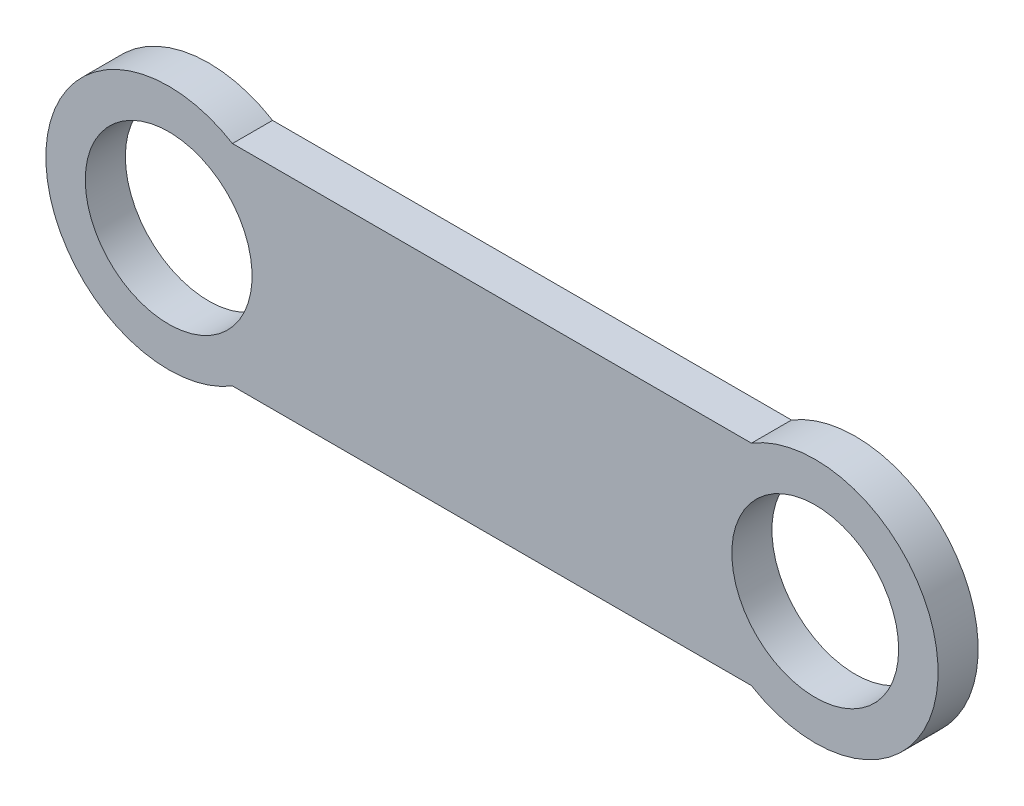
ISO-10303-21;
HEADER;
FILE_DESCRIPTION(('STEP AP214'),'2;1');
FILE_NAME('part.step','',(''),(''),'','','');
FILE_SCHEMA(('AUTOMOTIVE_DESIGN { 1 0 10303 214 1 1 1 1 }'));
ENDSEC;
DATA;
#1=APPLICATION_CONTEXT('core data for automotive mechanical design processes');
#2=APPLICATION_PROTOCOL_DEFINITION('international standard','automotive_design',2000,#1);
#3=PRODUCT_CONTEXT('',#1,'mechanical');
#4=PRODUCT('Part','Part','',(#3));
#5=PRODUCT_RELATED_PRODUCT_CATEGORY('part','',(#4));
#6=PRODUCT_DEFINITION_FORMATION('','',#4);
#7=PRODUCT_DEFINITION_CONTEXT('part definition',#1,'design');
#8=PRODUCT_DEFINITION('design','',#6,#7);
#9=PRODUCT_DEFINITION_SHAPE('','',#8);
#10=(LENGTH_UNIT() NAMED_UNIT(*) SI_UNIT(.MILLI.,.METRE.));
#11=(NAMED_UNIT(*) PLANE_ANGLE_UNIT() SI_UNIT($,.RADIAN.));
#12=(NAMED_UNIT(*) SI_UNIT($,.STERADIAN.) SOLID_ANGLE_UNIT());
#13=UNCERTAINTY_MEASURE_WITH_UNIT(LENGTH_MEASURE(1.E-05),#10,'distance_accuracy_value','');
#14=(GEOMETRIC_REPRESENTATION_CONTEXT(3) GLOBAL_UNCERTAINTY_ASSIGNED_CONTEXT((#13)) GLOBAL_UNIT_ASSIGNED_CONTEXT((#10,
#11,#12)) REPRESENTATION_CONTEXT('',''));
#15=CARTESIAN_POINT('',(0.,0.,0.));
#16=DIRECTION('',(0.,0.,1.));
#17=DIRECTION('',(1.,0.,0.));
#18=AXIS2_PLACEMENT_3D('',#15,#16,#17);
#19=CARTESIAN_POINT('',(25.,0.,3.1));
#20=DIRECTION('',(0.,0.,-1.));
#21=DIRECTION('',(-1.,0.,0.));
#22=AXIS2_PLACEMENT_3D('',#19,#20,#21);
#23=PLANE('',#22);
#24=CARTESIAN_POINT('',(25.,0.,3.1));
#25=DIRECTION('',(0.,0.,1.));
#26=DIRECTION('',(1.,0.,0.));
#27=AXIS2_PLACEMENT_3D('',#24,#25,#26);
#28=CIRCLE('',#27,6.45);
#29=CARTESIAN_POINT('',(31.45,0.,3.1));
#30=VERTEX_POINT('',#29);
#31=EDGE_CURVE('E99',#30,#30,#28,.T.);
#32=ORIENTED_EDGE('',*,*,#31,.F.);
#33=EDGE_LOOP('',(#32));
#34=FACE_BOUND('',#33,.T.);
#35=CARTESIAN_POINT('',(25.,0.,3.1));
#36=DIRECTION('',(0.,0.,1.));
#37=DIRECTION('',(-1.,0.,0.));
#38=AXIS2_PLACEMENT_3D('',#35,#36,#37);
#39=CIRCLE('',#38,9.5);
#40=CARTESIAN_POINT('',(20.0665095780993,-8.11853880061023,3.1));
#41=VERTEX_POINT('',#40);
#42=CARTESIAN_POINT('',(20.0665095780993,8.11853880061023,3.1));
#43=VERTEX_POINT('',#42);
#44=EDGE_CURVE('E84',#41,#43,#39,.T.);
#45=ORIENTED_EDGE('',*,*,#44,.T.);
#46=DIRECTION('',(-1.,0.,0.));
#47=VECTOR('',#46,1.);
#48=CARTESIAN_POINT('',(-20.0665095780993,8.11853880061023,3.1));
#49=LINE('',#48,#47);
#50=CARTESIAN_POINT('',(-20.0665095780993,8.11853880061023,3.1));
#51=VERTEX_POINT('',#50);
#52=EDGE_CURVE('E79',#43,#51,#49,.T.);
#53=ORIENTED_EDGE('',*,*,#52,.T.);
#54=CARTESIAN_POINT('',(-25.,0.,3.1));
#55=DIRECTION('',(0.,0.,1.));
#56=DIRECTION('',(1.,0.,0.));
#57=AXIS2_PLACEMENT_3D('',#54,#55,#56);
#58=CIRCLE('',#57,9.5);
#59=CARTESIAN_POINT('',(-20.0665095780993,-8.11853880061023,3.1));
#60=VERTEX_POINT('',#59);
#61=EDGE_CURVE('E82',#51,#60,#58,.T.);
#62=ORIENTED_EDGE('',*,*,#61,.T.);
#63=DIRECTION('',(1.,0.,0.));
#64=VECTOR('',#63,1.);
#65=CARTESIAN_POINT('',(-20.0665095780993,-8.11853880061023,3.1));
#66=LINE('',#65,#64);
#67=EDGE_CURVE('E49',#60,#41,#66,.T.);
#68=ORIENTED_EDGE('',*,*,#67,.T.);
#69=EDGE_LOOP('',(#45,#53,#62,#68));
#70=FACE_BOUND('',#69,.T.);
#71=CARTESIAN_POINT('',(-25.,0.,3.1));
#72=DIRECTION('',(0.,0.,1.));
#73=DIRECTION('',(-1.,0.,0.));
#74=AXIS2_PLACEMENT_3D('',#71,#72,#73);
#75=CIRCLE('',#74,6.45);
#76=CARTESIAN_POINT('',(-31.45,0.,3.1));
#77=VERTEX_POINT('',#76);
#78=EDGE_CURVE('E114',#77,#77,#75,.T.);
#79=ORIENTED_EDGE('',*,*,#78,.F.);
#80=EDGE_LOOP('',(#79));
#81=FACE_BOUND('',#80,.T.);
#82=ADVANCED_FACE('F32',(#34,#70,#81),#23,.F.);
#83=CARTESIAN_POINT('',(25.,0.,0.));
#84=DIRECTION('',(0.,0.,-1.));
#85=DIRECTION('',(-1.,0.,0.));
#86=AXIS2_PLACEMENT_3D('',#83,#84,#85);
#87=PLANE('',#86);
#88=CARTESIAN_POINT('',(25.,0.,0.));
#89=DIRECTION('',(0.,0.,1.));
#90=DIRECTION('',(1.,0.,0.));
#91=AXIS2_PLACEMENT_3D('',#88,#89,#90);
#92=CIRCLE('',#91,6.45);
#93=CARTESIAN_POINT('',(31.45,0.,0.));
#94=VERTEX_POINT('',#93);
#95=EDGE_CURVE('E111',#94,#94,#92,.T.);
#96=ORIENTED_EDGE('',*,*,#95,.T.);
#97=EDGE_LOOP('',(#96));
#98=FACE_BOUND('',#97,.T.);
#99=CARTESIAN_POINT('',(25.,0.,0.));
#100=DIRECTION('',(0.,0.,1.));
#101=DIRECTION('',(-1.,0.,0.));
#102=AXIS2_PLACEMENT_3D('',#99,#100,#101);
#103=CIRCLE('',#102,9.5);
#104=CARTESIAN_POINT('',(20.0665095780993,-8.11853880061023,0.));
#105=VERTEX_POINT('',#104);
#106=CARTESIAN_POINT('',(20.0665095780993,8.11853880061023,0.));
#107=VERTEX_POINT('',#106);
#108=EDGE_CURVE('E96',#105,#107,#103,.T.);
#109=ORIENTED_EDGE('',*,*,#108,.F.);
#110=DIRECTION('',(1.,0.,0.));
#111=VECTOR('',#110,1.);
#112=CARTESIAN_POINT('',(-20.0665095780993,-8.11853880061023,0.));
#113=LINE('',#112,#111);
#114=CARTESIAN_POINT('',(-20.0665095780993,-8.11853880061023,0.));
#115=VERTEX_POINT('',#114);
#116=EDGE_CURVE('E72',#115,#105,#113,.T.);
#117=ORIENTED_EDGE('',*,*,#116,.F.);
#118=CARTESIAN_POINT('',(-25.,0.,0.));
#119=DIRECTION('',(0.,0.,1.));
#120=DIRECTION('',(1.,0.,0.));
#121=AXIS2_PLACEMENT_3D('',#118,#119,#120);
#122=CIRCLE('',#121,9.5);
#123=CARTESIAN_POINT('',(-20.0665095780993,8.11853880061023,0.));
#124=VERTEX_POINT('',#123);
#125=EDGE_CURVE('E66',#124,#115,#122,.T.);
#126=ORIENTED_EDGE('',*,*,#125,.F.);
#127=DIRECTION('',(-1.,0.,0.));
#128=VECTOR('',#127,1.);
#129=CARTESIAN_POINT('',(-20.0665095780993,8.11853880061023,0.));
#130=LINE('',#129,#128);
#131=EDGE_CURVE('E88',#107,#124,#130,.T.);
#132=ORIENTED_EDGE('',*,*,#131,.F.);
#133=EDGE_LOOP('',(#109,#117,#126,#132));
#134=FACE_BOUND('',#133,.T.);
#135=CARTESIAN_POINT('',(-25.,0.,0.));
#136=DIRECTION('',(0.,0.,1.));
#137=DIRECTION('',(-1.,0.,0.));
#138=AXIS2_PLACEMENT_3D('',#135,#136,#137);
#139=CIRCLE('',#138,6.45);
#140=CARTESIAN_POINT('',(-31.45,0.,0.));
#141=VERTEX_POINT('',#140);
#142=EDGE_CURVE('E117',#141,#141,#139,.T.);
#143=ORIENTED_EDGE('',*,*,#142,.T.);
#144=EDGE_LOOP('',(#143));
#145=FACE_BOUND('',#144,.T.);
#146=ADVANCED_FACE('F107',(#98,#134,#145),#87,.T.);
#147=CARTESIAN_POINT('',(25.,0.,3.1));
#148=DIRECTION('',(0.,0.,-1.));
#149=DIRECTION('',(-1.,0.,0.));
#150=AXIS2_PLACEMENT_3D('',#147,#148,#149);
#151=CYLINDRICAL_SURFACE('',#150,9.5);
#152=ORIENTED_EDGE('',*,*,#108,.T.);
#153=DIRECTION('',(0.,0.,-1.));
#154=VECTOR('',#153,1.);
#155=CARTESIAN_POINT('',(20.0665095780993,8.11853880061023,3.1));
#156=LINE('',#155,#154);
#157=EDGE_CURVE('E11',#43,#107,#156,.T.);
#158=ORIENTED_EDGE('',*,*,#157,.F.);
#159=ORIENTED_EDGE('',*,*,#44,.F.);
#160=DIRECTION('',(0.,0.,-1.));
#161=VECTOR('',#160,1.);
#162=CARTESIAN_POINT('',(20.0665095780993,-8.11853880061023,3.1));
#163=LINE('',#162,#161);
#164=EDGE_CURVE('E92',#41,#105,#163,.T.);
#165=ORIENTED_EDGE('',*,*,#164,.T.);
#166=EDGE_LOOP('',(#152,#158,#159,#165));
#167=FACE_BOUND('',#166,.T.);
#168=ADVANCED_FACE('F34',(#167),#151,.T.);
#169=CARTESIAN_POINT('',(-20.0665095780993,8.11853880061023,3.1));
#170=DIRECTION('',(0.,-1.,0.));
#171=DIRECTION('',(0.,0.,-1.));
#172=AXIS2_PLACEMENT_3D('',#169,#170,#171);
#173=PLANE('',#172);
#174=ORIENTED_EDGE('',*,*,#131,.T.);
#175=DIRECTION('',(0.,0.,-1.));
#176=VECTOR('',#175,1.);
#177=CARTESIAN_POINT('',(-20.0665095780993,8.11853880061023,3.1));
#178=LINE('',#177,#176);
#179=EDGE_CURVE('E41',#51,#124,#178,.T.);
#180=ORIENTED_EDGE('',*,*,#179,.F.);
#181=ORIENTED_EDGE('',*,*,#52,.F.);
#182=ORIENTED_EDGE('',*,*,#157,.T.);
#183=EDGE_LOOP('',(#174,#180,#181,#182));
#184=FACE_BOUND('',#183,.T.);
#185=ADVANCED_FACE('F87',(#184),#173,.F.);
#186=CARTESIAN_POINT('',(-25.,0.,3.1));
#187=DIRECTION('',(0.,0.,-1.));
#188=DIRECTION('',(-1.,0.,0.));
#189=AXIS2_PLACEMENT_3D('',#186,#187,#188);
#190=CYLINDRICAL_SURFACE('',#189,9.5);
#191=ORIENTED_EDGE('',*,*,#125,.T.);
#192=DIRECTION('',(0.,0.,-1.));
#193=VECTOR('',#192,1.);
#194=CARTESIAN_POINT('',(-20.0665095780993,-8.11853880061023,3.1));
#195=LINE('',#194,#193);
#196=EDGE_CURVE('E89',#60,#115,#195,.T.);
#197=ORIENTED_EDGE('',*,*,#196,.F.);
#198=ORIENTED_EDGE('',*,*,#61,.F.);
#199=ORIENTED_EDGE('',*,*,#179,.T.);
#200=EDGE_LOOP('',(#191,#197,#198,#199));
#201=FACE_BOUND('',#200,.T.);
#202=ADVANCED_FACE('F90',(#201),#190,.T.);
#203=CARTESIAN_POINT('',(-20.0665095780993,-8.11853880061023,3.1));
#204=DIRECTION('',(0.,1.,0.));
#205=DIRECTION('',(0.,0.,1.));
#206=AXIS2_PLACEMENT_3D('',#203,#204,#205);
#207=PLANE('',#206);
#208=ORIENTED_EDGE('',*,*,#116,.T.);
#209=ORIENTED_EDGE('',*,*,#164,.F.);
#210=ORIENTED_EDGE('',*,*,#67,.F.);
#211=ORIENTED_EDGE('',*,*,#196,.T.);
#212=EDGE_LOOP('',(#208,#209,#210,#211));
#213=FACE_BOUND('',#212,.T.);
#214=ADVANCED_FACE('F104',(#213),#207,.F.);
#215=CARTESIAN_POINT('',(25.,0.,3.1));
#216=DIRECTION('',(0.,0.,-1.));
#217=DIRECTION('',(-1.,0.,0.));
#218=AXIS2_PLACEMENT_3D('',#215,#216,#217);
#219=CYLINDRICAL_SURFACE('',#218,6.45);
#220=ORIENTED_EDGE('',*,*,#31,.T.);
#221=EDGE_LOOP('',(#220));
#222=FACE_BOUND('',#221,.T.);
#223=ORIENTED_EDGE('',*,*,#95,.F.);
#224=EDGE_LOOP('',(#223));
#225=FACE_BOUND('',#224,.T.);
#226=ADVANCED_FACE('F135',(#222,#225),#219,.F.);
#227=CARTESIAN_POINT('',(-25.,0.,3.1));
#228=DIRECTION('',(0.,0.,-1.));
#229=DIRECTION('',(-1.,0.,0.));
#230=AXIS2_PLACEMENT_3D('',#227,#228,#229);
#231=CYLINDRICAL_SURFACE('',#230,6.45);
#232=ORIENTED_EDGE('',*,*,#78,.T.);
#233=EDGE_LOOP('',(#232));
#234=FACE_BOUND('',#233,.T.);
#235=ORIENTED_EDGE('',*,*,#142,.F.);
#236=EDGE_LOOP('',(#235));
#237=FACE_BOUND('',#236,.T.);
#238=ADVANCED_FACE('F123',(#234,#237),#231,.F.);
#239=CLOSED_SHELL('',(#82,#146,#168,#185,#202,#214,#226,#238));
#240=MANIFOLD_SOLID_BREP('B2',#239);
#241=ADVANCED_BREP_SHAPE_REPRESENTATION('',(#18,#240),#14);
#242=SHAPE_DEFINITION_REPRESENTATION(#9,#241);
ENDSEC;
END-ISO-10303-21;
